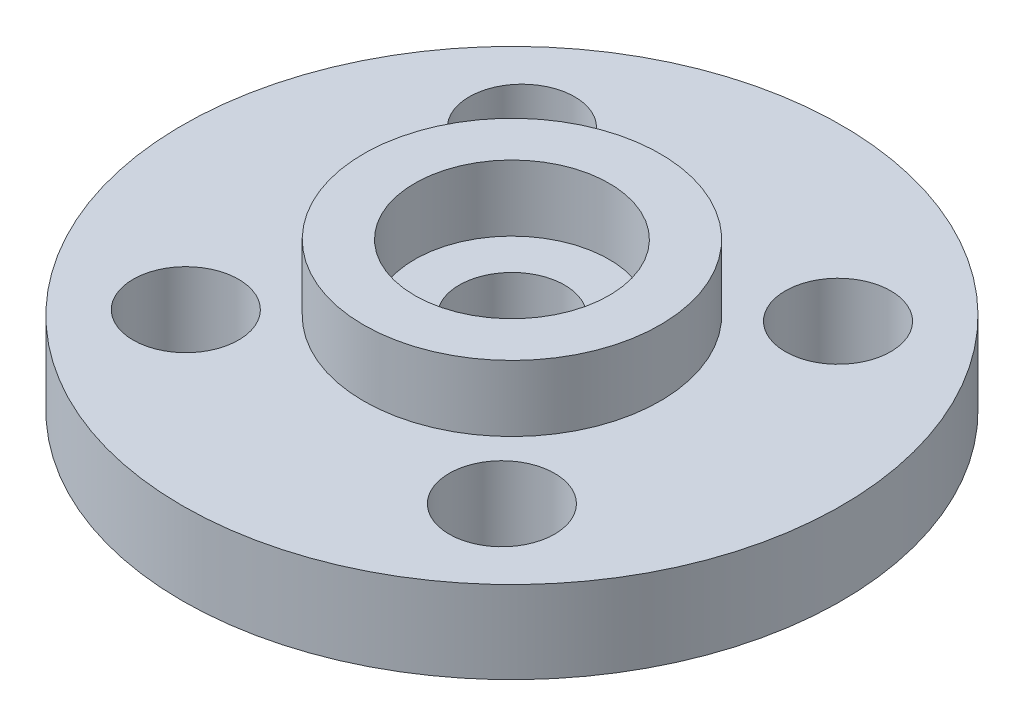
ISO-10303-21;
HEADER;
FILE_DESCRIPTION(('STEP AP214'),'2;1');
FILE_NAME('part.step','',(''),(''),'','','');
FILE_SCHEMA(('AUTOMOTIVE_DESIGN { 1 0 10303 214 1 1 1 1 }'));
ENDSEC;
DATA;
#1=APPLICATION_CONTEXT('core data for automotive mechanical design processes');
#2=APPLICATION_PROTOCOL_DEFINITION('international standard','automotive_design',2000,#1);
#3=PRODUCT_CONTEXT('',#1,'mechanical');
#4=PRODUCT('Part','Part','',(#3));
#5=PRODUCT_RELATED_PRODUCT_CATEGORY('part','',(#4));
#6=PRODUCT_DEFINITION_FORMATION('','',#4);
#7=PRODUCT_DEFINITION_CONTEXT('part definition',#1,'design');
#8=PRODUCT_DEFINITION('design','',#6,#7);
#9=PRODUCT_DEFINITION_SHAPE('','',#8);
#10=(LENGTH_UNIT() NAMED_UNIT(*) SI_UNIT(.MILLI.,.METRE.));
#11=(NAMED_UNIT(*) PLANE_ANGLE_UNIT() SI_UNIT($,.RADIAN.));
#12=(NAMED_UNIT(*) SI_UNIT($,.STERADIAN.) SOLID_ANGLE_UNIT());
#13=UNCERTAINTY_MEASURE_WITH_UNIT(LENGTH_MEASURE(1.E-05),#10,'distance_accuracy_value','');
#14=(GEOMETRIC_REPRESENTATION_CONTEXT(3) GLOBAL_UNCERTAINTY_ASSIGNED_CONTEXT((#13)) GLOBAL_UNIT_ASSIGNED_CONTEXT((#10,
#11,#12)) REPRESENTATION_CONTEXT('',''));
#15=CARTESIAN_POINT('',(0.,0.,0.));
#16=DIRECTION('',(0.,0.,1.));
#17=DIRECTION('',(1.,0.,0.));
#18=AXIS2_PLACEMENT_3D('',#15,#16,#17);
#19=CARTESIAN_POINT('',(0.,2.5,0.));
#20=DIRECTION('',(0.,-1.,0.));
#21=DIRECTION('',(0.,0.,-1.));
#22=AXIS2_PLACEMENT_3D('',#19,#20,#21);
#23=CYLINDRICAL_SURFACE('',#22,10.);
#24=CARTESIAN_POINT('',(0.,2.5,0.));
#25=DIRECTION('',(0.,1.,0.));
#26=DIRECTION('',(0.,0.,1.));
#27=AXIS2_PLACEMENT_3D('',#24,#25,#26);
#28=CIRCLE('',#27,10.);
#29=CARTESIAN_POINT('',(0.,2.5,10.));
#30=VERTEX_POINT('',#29);
#31=EDGE_CURVE('E10',#30,#30,#28,.T.);
#32=ORIENTED_EDGE('',*,*,#31,.F.);
#33=EDGE_LOOP('',(#32));
#34=FACE_BOUND('',#33,.T.);
#35=CARTESIAN_POINT('',(0.,0.,0.));
#36=DIRECTION('',(0.,1.,0.));
#37=DIRECTION('',(0.,0.,1.));
#38=AXIS2_PLACEMENT_3D('',#35,#36,#37);
#39=CIRCLE('',#38,10.);
#40=CARTESIAN_POINT('',(0.,0.,10.));
#41=VERTEX_POINT('',#40);
#42=EDGE_CURVE('E40',#41,#41,#39,.T.);
#43=ORIENTED_EDGE('',*,*,#42,.T.);
#44=EDGE_LOOP('',(#43));
#45=FACE_BOUND('',#44,.T.);
#46=ADVANCED_FACE('F37',(#34,#45),#23,.T.);
#47=CARTESIAN_POINT('',(0.,2.5,0.));
#48=DIRECTION('',(0.,1.,0.));
#49=DIRECTION('',(0.,0.,1.));
#50=AXIS2_PLACEMENT_3D('',#47,#48,#49);
#51=PLANE('',#50);
#52=CARTESIAN_POINT('',(0.,2.5,0.));
#53=DIRECTION('',(0.,1.,0.));
#54=DIRECTION('',(0.,0.,1.));
#55=AXIS2_PLACEMENT_3D('',#52,#53,#54);
#56=CIRCLE('',#55,4.5);
#57=CARTESIAN_POINT('',(0.,2.5,4.5));
#58=VERTEX_POINT('',#57);
#59=EDGE_CURVE('E91',#58,#58,#56,.T.);
#60=ORIENTED_EDGE('',*,*,#59,.F.);
#61=EDGE_LOOP('',(#60));
#62=FACE_BOUND('',#61,.T.);
#63=CARTESIAN_POINT('',(5.09957864277976,2.5,-4.79523697705385));
#64=DIRECTION('',(0.,1.,0.));
#65=DIRECTION('',(0.,0.,1.));
#66=AXIS2_PLACEMENT_3D('',#63,#64,#65);
#67=CIRCLE('',#66,1.6);
#68=CARTESIAN_POINT('',(5.09957864277976,2.5,-3.19523697705385));
#69=VERTEX_POINT('',#68);
#70=EDGE_CURVE('E59',#69,#69,#67,.T.);
#71=ORIENTED_EDGE('',*,*,#70,.F.);
#72=EDGE_LOOP('',(#71));
#73=FACE_BOUND('',#72,.T.);
#74=CARTESIAN_POINT('',(4.79523697705385,2.5,5.09957864277976));
#75=DIRECTION('',(0.,1.,0.));
#76=DIRECTION('',(0.,0.,1.));
#77=AXIS2_PLACEMENT_3D('',#74,#75,#76);
#78=CIRCLE('',#77,1.6);
#79=CARTESIAN_POINT('',(4.79523697705385,2.5,6.69957864277976));
#80=VERTEX_POINT('',#79);
#81=EDGE_CURVE('E68',#80,#80,#78,.T.);
#82=ORIENTED_EDGE('',*,*,#81,.F.);
#83=EDGE_LOOP('',(#82));
#84=FACE_BOUND('',#83,.T.);
#85=CARTESIAN_POINT('',(-5.09957864277976,2.5,4.79523697705385));
#86=DIRECTION('',(0.,1.,0.));
#87=DIRECTION('',(0.,0.,1.));
#88=AXIS2_PLACEMENT_3D('',#85,#86,#87);
#89=CIRCLE('',#88,1.6);
#90=CARTESIAN_POINT('',(-5.09957864277976,2.5,6.39523697705385));
#91=VERTEX_POINT('',#90);
#92=EDGE_CURVE('E76',#91,#91,#89,.T.);
#93=ORIENTED_EDGE('',*,*,#92,.F.);
#94=EDGE_LOOP('',(#93));
#95=FACE_BOUND('',#94,.T.);
#96=CARTESIAN_POINT('',(-4.79523697705385,2.5,-5.09957864277976));
#97=DIRECTION('',(0.,1.,0.));
#98=DIRECTION('',(0.,0.,1.));
#99=AXIS2_PLACEMENT_3D('',#96,#97,#98);
#100=CIRCLE('',#99,1.6);
#101=CARTESIAN_POINT('',(-4.79523697705385,2.5,-3.49957864277976));
#102=VERTEX_POINT('',#101);
#103=EDGE_CURVE('E51',#102,#102,#100,.T.);
#104=ORIENTED_EDGE('',*,*,#103,.F.);
#105=EDGE_LOOP('',(#104));
#106=FACE_BOUND('',#105,.T.);
#107=ORIENTED_EDGE('',*,*,#31,.T.);
#108=EDGE_LOOP('',(#107));
#109=FACE_BOUND('',#108,.T.);
#110=ADVANCED_FACE('F129',(#62,#73,#84,#95,#106,#109),#51,.T.);
#111=CARTESIAN_POINT('',(0.,0.,0.));
#112=DIRECTION('',(0.,1.,0.));
#113=DIRECTION('',(0.,0.,1.));
#114=AXIS2_PLACEMENT_3D('',#111,#112,#113);
#115=PLANE('',#114);
#116=CARTESIAN_POINT('',(5.09957864277976,0.,-4.79523697705385));
#117=DIRECTION('',(0.,1.,0.));
#118=DIRECTION('',(0.,0.,1.));
#119=AXIS2_PLACEMENT_3D('',#116,#117,#118);
#120=CIRCLE('',#119,1.6);
#121=CARTESIAN_POINT('',(5.09957864277976,0.,-3.19523697705385));
#122=VERTEX_POINT('',#121);
#123=EDGE_CURVE('E63',#122,#122,#120,.T.);
#124=ORIENTED_EDGE('',*,*,#123,.T.);
#125=EDGE_LOOP('',(#124));
#126=FACE_BOUND('',#125,.T.);
#127=CARTESIAN_POINT('',(4.79523697705385,0.,5.09957864277976));
#128=DIRECTION('',(0.,1.,0.));
#129=DIRECTION('',(0.,0.,1.));
#130=AXIS2_PLACEMENT_3D('',#127,#128,#129);
#131=CIRCLE('',#130,1.6);
#132=CARTESIAN_POINT('',(4.79523697705385,0.,6.69957864277976));
#133=VERTEX_POINT('',#132);
#134=EDGE_CURVE('E72',#133,#133,#131,.T.);
#135=ORIENTED_EDGE('',*,*,#134,.T.);
#136=EDGE_LOOP('',(#135));
#137=FACE_BOUND('',#136,.T.);
#138=CARTESIAN_POINT('',(-5.09957864277976,0.,4.79523697705385));
#139=DIRECTION('',(0.,1.,0.));
#140=DIRECTION('',(0.,0.,1.));
#141=AXIS2_PLACEMENT_3D('',#138,#139,#140);
#142=CIRCLE('',#141,1.6);
#143=CARTESIAN_POINT('',(-5.09957864277976,0.,6.39523697705385));
#144=VERTEX_POINT('',#143);
#145=EDGE_CURVE('E80',#144,#144,#142,.T.);
#146=ORIENTED_EDGE('',*,*,#145,.T.);
#147=EDGE_LOOP('',(#146));
#148=FACE_BOUND('',#147,.T.);
#149=CARTESIAN_POINT('',(0.,0.,0.));
#150=DIRECTION('',(0.,1.,0.));
#151=DIRECTION('',(0.,0.,1.));
#152=AXIS2_PLACEMENT_3D('',#149,#150,#151);
#153=CIRCLE('',#152,1.6);
#154=CARTESIAN_POINT('',(0.,0.,1.6));
#155=VERTEX_POINT('',#154);
#156=EDGE_CURVE('E55',#155,#155,#153,.T.);
#157=ORIENTED_EDGE('',*,*,#156,.T.);
#158=EDGE_LOOP('',(#157));
#159=FACE_BOUND('',#158,.T.);
#160=CARTESIAN_POINT('',(-4.79523697705385,0.,-5.09957864277976));
#161=DIRECTION('',(0.,1.,0.));
#162=DIRECTION('',(0.,0.,1.));
#163=AXIS2_PLACEMENT_3D('',#160,#161,#162);
#164=CIRCLE('',#163,1.6);
#165=CARTESIAN_POINT('',(-4.79523697705385,0.,-3.49957864277976));
#166=VERTEX_POINT('',#165);
#167=EDGE_CURVE('E49',#166,#166,#164,.T.);
#168=ORIENTED_EDGE('',*,*,#167,.T.);
#169=EDGE_LOOP('',(#168));
#170=FACE_BOUND('',#169,.T.);
#171=ORIENTED_EDGE('',*,*,#42,.F.);
#172=EDGE_LOOP('',(#171));
#173=FACE_BOUND('',#172,.T.);
#174=ADVANCED_FACE('F132',(#126,#137,#148,#159,#170,#173),#115,.F.);
#175=CARTESIAN_POINT('',(-4.79523697705385,0.,-5.09957864277976));
#176=DIRECTION('',(0.,1.,0.));
#177=DIRECTION('',(0.,0.,1.));
#178=AXIS2_PLACEMENT_3D('',#175,#176,#177);
#179=CYLINDRICAL_SURFACE('',#178,1.6);
#180=ORIENTED_EDGE('',*,*,#167,.F.);
#181=EDGE_LOOP('',(#180));
#182=FACE_BOUND('',#181,.T.);
#183=ORIENTED_EDGE('',*,*,#103,.T.);
#184=EDGE_LOOP('',(#183));
#185=FACE_BOUND('',#184,.T.);
#186=ADVANCED_FACE('F142',(#182,#185),#179,.F.);
#187=CARTESIAN_POINT('',(0.,0.,0.));
#188=DIRECTION('',(0.,1.,0.));
#189=DIRECTION('',(0.,0.,1.));
#190=AXIS2_PLACEMENT_3D('',#187,#188,#189);
#191=CYLINDRICAL_SURFACE('',#190,1.6);
#192=ORIENTED_EDGE('',*,*,#156,.F.);
#193=EDGE_LOOP('',(#192));
#194=FACE_BOUND('',#193,.T.);
#195=CARTESIAN_POINT('',(0.,2.5,0.));
#196=DIRECTION('',(0.,1.,0.));
#197=DIRECTION('',(0.,0.,1.));
#198=AXIS2_PLACEMENT_3D('',#195,#196,#197);
#199=CIRCLE('',#198,1.6);
#200=CARTESIAN_POINT('',(0.,2.5,1.6));
#201=VERTEX_POINT('',#200);
#202=EDGE_CURVE('E87',#201,#201,#199,.F.);
#203=ORIENTED_EDGE('',*,*,#202,.F.);
#204=EDGE_LOOP('',(#203));
#205=FACE_BOUND('',#204,.T.);
#206=ADVANCED_FACE('F144',(#194,#205),#191,.F.);
#207=CARTESIAN_POINT('',(-5.09957864277976,0.,4.79523697705385));
#208=DIRECTION('',(0.,1.,0.));
#209=DIRECTION('',(0.,0.,1.));
#210=AXIS2_PLACEMENT_3D('',#207,#208,#209);
#211=CYLINDRICAL_SURFACE('',#210,1.6);
#212=ORIENTED_EDGE('',*,*,#145,.F.);
#213=EDGE_LOOP('',(#212));
#214=FACE_BOUND('',#213,.T.);
#215=ORIENTED_EDGE('',*,*,#92,.T.);
#216=EDGE_LOOP('',(#215));
#217=FACE_BOUND('',#216,.T.);
#218=ADVANCED_FACE('F151',(#214,#217),#211,.F.);
#219=CARTESIAN_POINT('',(4.79523697705385,0.,5.09957864277976));
#220=DIRECTION('',(0.,1.,0.));
#221=DIRECTION('',(0.,0.,1.));
#222=AXIS2_PLACEMENT_3D('',#219,#220,#221);
#223=CYLINDRICAL_SURFACE('',#222,1.6);
#224=ORIENTED_EDGE('',*,*,#134,.F.);
#225=EDGE_LOOP('',(#224));
#226=FACE_BOUND('',#225,.T.);
#227=ORIENTED_EDGE('',*,*,#81,.T.);
#228=EDGE_LOOP('',(#227));
#229=FACE_BOUND('',#228,.T.);
#230=ADVANCED_FACE('F193',(#226,#229),#223,.F.);
#231=CARTESIAN_POINT('',(5.09957864277976,0.,-4.79523697705385));
#232=DIRECTION('',(0.,1.,0.));
#233=DIRECTION('',(0.,0.,1.));
#234=AXIS2_PLACEMENT_3D('',#231,#232,#233);
#235=CYLINDRICAL_SURFACE('',#234,1.6);
#236=ORIENTED_EDGE('',*,*,#123,.F.);
#237=EDGE_LOOP('',(#236));
#238=FACE_BOUND('',#237,.T.);
#239=ORIENTED_EDGE('',*,*,#70,.T.);
#240=EDGE_LOOP('',(#239));
#241=FACE_BOUND('',#240,.T.);
#242=ADVANCED_FACE('F125',(#238,#241),#235,.F.);
#243=CARTESIAN_POINT('',(0.,4.5,0.));
#244=DIRECTION('',(0.,-1.,0.));
#245=DIRECTION('',(0.,0.,-1.));
#246=AXIS2_PLACEMENT_3D('',#243,#244,#245);
#247=CYLINDRICAL_SURFACE('',#246,4.5);
#248=CARTESIAN_POINT('',(0.,4.5,0.));
#249=DIRECTION('',(0.,1.,0.));
#250=DIRECTION('',(0.,0.,1.));
#251=AXIS2_PLACEMENT_3D('',#248,#249,#250);
#252=CIRCLE('',#251,4.5);
#253=CARTESIAN_POINT('',(0.,4.5,4.5));
#254=VERTEX_POINT('',#253);
#255=EDGE_CURVE('E64',#254,#254,#252,.T.);
#256=ORIENTED_EDGE('',*,*,#255,.F.);
#257=EDGE_LOOP('',(#256));
#258=FACE_BOUND('',#257,.T.);
#259=ORIENTED_EDGE('',*,*,#59,.T.);
#260=EDGE_LOOP('',(#259));
#261=FACE_BOUND('',#260,.T.);
#262=ADVANCED_FACE('F119',(#258,#261),#247,.T.);
#263=CARTESIAN_POINT('',(0.,4.5,0.));
#264=DIRECTION('',(0.,1.,0.));
#265=DIRECTION('',(0.,0.,1.));
#266=AXIS2_PLACEMENT_3D('',#263,#264,#265);
#267=PLANE('',#266);
#268=CARTESIAN_POINT('',(0.,4.5,0.));
#269=DIRECTION('',(0.,1.,0.));
#270=DIRECTION('',(0.,0.,1.));
#271=AXIS2_PLACEMENT_3D('',#268,#269,#270);
#272=CIRCLE('',#271,2.95);
#273=CARTESIAN_POINT('',(0.,4.5,2.95));
#274=VERTEX_POINT('',#273);
#275=EDGE_CURVE('E99',#274,#274,#272,.T.);
#276=ORIENTED_EDGE('',*,*,#275,.F.);
#277=EDGE_LOOP('',(#276));
#278=FACE_BOUND('',#277,.T.);
#279=ORIENTED_EDGE('',*,*,#255,.T.);
#280=EDGE_LOOP('',(#279));
#281=FACE_BOUND('',#280,.T.);
#282=ADVANCED_FACE('F116',(#278,#281),#267,.T.);
#283=CARTESIAN_POINT('',(0.,2.5,0.));
#284=DIRECTION('',(0.,1.,0.));
#285=DIRECTION('',(0.,0.,1.));
#286=AXIS2_PLACEMENT_3D('',#283,#284,#285);
#287=PLANE('',#286);
#288=CARTESIAN_POINT('',(0.,2.5,0.));
#289=DIRECTION('',(0.,1.,0.));
#290=DIRECTION('',(0.,0.,1.));
#291=AXIS2_PLACEMENT_3D('',#288,#289,#290);
#292=CIRCLE('',#291,2.95);
#293=CARTESIAN_POINT('',(0.,2.5,2.95));
#294=VERTEX_POINT('',#293);
#295=EDGE_CURVE('E92',#294,#294,#292,.T.);
#296=ORIENTED_EDGE('',*,*,#295,.T.);
#297=EDGE_LOOP('',(#296));
#298=FACE_BOUND('',#297,.T.);
#299=ORIENTED_EDGE('',*,*,#202,.T.);
#300=EDGE_LOOP('',(#299));
#301=FACE_BOUND('',#300,.T.);
#302=ADVANCED_FACE('F107',(#298,#301),#287,.T.);
#303=CARTESIAN_POINT('',(0.,2.5,0.));
#304=DIRECTION('',(0.,1.,0.));
#305=DIRECTION('',(0.,0.,1.));
#306=AXIS2_PLACEMENT_3D('',#303,#304,#305);
#307=CYLINDRICAL_SURFACE('',#306,2.95);
#308=ORIENTED_EDGE('',*,*,#295,.F.);
#309=EDGE_LOOP('',(#308));
#310=FACE_BOUND('',#309,.T.);
#311=ORIENTED_EDGE('',*,*,#275,.T.);
#312=EDGE_LOOP('',(#311));
#313=FACE_BOUND('',#312,.T.);
#314=ADVANCED_FACE('F110',(#310,#313),#307,.F.);
#315=CLOSED_SHELL('',(#46,#110,#174,#186,#206,#218,#230,#242,#262,#282,#302,#314));
#316=MANIFOLD_SOLID_BREP('B2',#315);
#317=ADVANCED_BREP_SHAPE_REPRESENTATION('',(#18,#316),#14);
#318=SHAPE_DEFINITION_REPRESENTATION(#9,#317);
ENDSEC;
END-ISO-10303-21;
